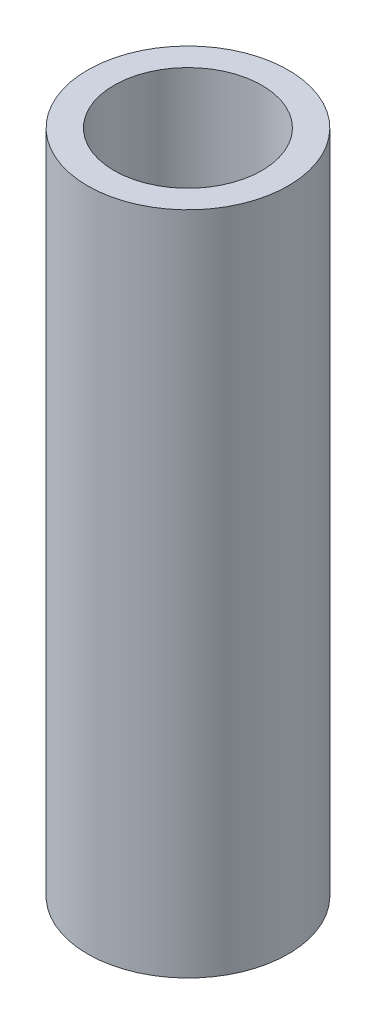
ISO-10303-21;
HEADER;
FILE_DESCRIPTION(('STEP AP214'),'2;1');
FILE_NAME('part.step','',(''),(''),'','','');
FILE_SCHEMA(('AUTOMOTIVE_DESIGN { 1 0 10303 214 1 1 1 1 }'));
ENDSEC;
DATA;
#1=APPLICATION_CONTEXT('core data for automotive mechanical design processes');
#2=APPLICATION_PROTOCOL_DEFINITION('international standard','automotive_design',2000,#1);
#3=PRODUCT_CONTEXT('',#1,'mechanical');
#4=PRODUCT('Part','Part','',(#3));
#5=PRODUCT_RELATED_PRODUCT_CATEGORY('part','',(#4));
#6=PRODUCT_DEFINITION_FORMATION('','',#4);
#7=PRODUCT_DEFINITION_CONTEXT('part definition',#1,'design');
#8=PRODUCT_DEFINITION('design','',#6,#7);
#9=PRODUCT_DEFINITION_SHAPE('','',#8);
#10=(LENGTH_UNIT() NAMED_UNIT(*) SI_UNIT(.MILLI.,.METRE.));
#11=(NAMED_UNIT(*) PLANE_ANGLE_UNIT() SI_UNIT($,.RADIAN.));
#12=(NAMED_UNIT(*) SI_UNIT($,.STERADIAN.) SOLID_ANGLE_UNIT());
#13=UNCERTAINTY_MEASURE_WITH_UNIT(LENGTH_MEASURE(1.E-05),#10,'distance_accuracy_value','');
#14=(GEOMETRIC_REPRESENTATION_CONTEXT(3) GLOBAL_UNCERTAINTY_ASSIGNED_CONTEXT((#13)) GLOBAL_UNIT_ASSIGNED_CONTEXT((#10,
#11,#12)) REPRESENTATION_CONTEXT('',''));
#15=CARTESIAN_POINT('',(0.,0.,0.));
#16=DIRECTION('',(0.,0.,1.));
#17=DIRECTION('',(1.,0.,0.));
#18=AXIS2_PLACEMENT_3D('',#15,#16,#17);
#19=CARTESIAN_POINT('',(0.,-2.,0.));
#20=DIRECTION('',(0.,1.,0.));
#21=DIRECTION('',(0.,0.,1.));
#22=AXIS2_PLACEMENT_3D('',#19,#20,#21);
#23=CYLINDRICAL_SURFACE('',#22,1.2065);
#24=CARTESIAN_POINT('',(0.,-2.,0.));
#25=DIRECTION('',(0.,1.,0.));
#26=DIRECTION('',(0.,0.,1.));
#27=AXIS2_PLACEMENT_3D('',#24,#25,#26);
#28=CIRCLE('',#27,1.2065);
#29=CARTESIAN_POINT('',(0.,-2.,1.2065));
#30=VERTEX_POINT('',#29);
#31=EDGE_CURVE('E10',#30,#30,#28,.T.);
#32=ORIENTED_EDGE('',*,*,#31,.T.);
#33=EDGE_LOOP('',(#32));
#34=FACE_BOUND('',#33,.T.);
#35=CARTESIAN_POINT('',(0.,6.,0.));
#36=DIRECTION('',(0.,1.,0.));
#37=DIRECTION('',(0.,0.,1.));
#38=AXIS2_PLACEMENT_3D('',#35,#36,#37);
#39=CIRCLE('',#38,1.2065);
#40=CARTESIAN_POINT('',(0.,6.,1.2065));
#41=VERTEX_POINT('',#40);
#42=EDGE_CURVE('E41',#41,#41,#39,.T.);
#43=ORIENTED_EDGE('',*,*,#42,.F.);
#44=EDGE_LOOP('',(#43));
#45=FACE_BOUND('',#44,.T.);
#46=ADVANCED_FACE('F31',(#34,#45),#23,.T.);
#47=CARTESIAN_POINT('',(0.,-2.,0.));
#48=DIRECTION('',(0.,1.,0.));
#49=DIRECTION('',(0.,0.,1.));
#50=AXIS2_PLACEMENT_3D('',#47,#48,#49);
#51=PLANE('',#50);
#52=CARTESIAN_POINT('',(0.,-2.,0.));
#53=DIRECTION('',(0.,1.,0.));
#54=DIRECTION('',(0.,0.,1.));
#55=AXIS2_PLACEMENT_3D('',#52,#53,#54);
#56=CIRCLE('',#55,0.889);
#57=CARTESIAN_POINT('',(0.,-2.,0.889));
#58=VERTEX_POINT('',#57);
#59=EDGE_CURVE('E37',#58,#58,#56,.T.);
#60=ORIENTED_EDGE('',*,*,#59,.T.);
#61=EDGE_LOOP('',(#60));
#62=FACE_BOUND('',#61,.T.);
#63=ORIENTED_EDGE('',*,*,#31,.F.);
#64=EDGE_LOOP('',(#63));
#65=FACE_BOUND('',#64,.T.);
#66=ADVANCED_FACE('F60',(#62,#65),#51,.F.);
#67=CARTESIAN_POINT('',(0.,-2.,0.));
#68=DIRECTION('',(0.,1.,0.));
#69=DIRECTION('',(0.,0.,1.));
#70=AXIS2_PLACEMENT_3D('',#67,#68,#69);
#71=CYLINDRICAL_SURFACE('',#70,0.889);
#72=ORIENTED_EDGE('',*,*,#59,.F.);
#73=EDGE_LOOP('',(#72));
#74=FACE_BOUND('',#73,.T.);
#75=CARTESIAN_POINT('',(0.,6.,0.));
#76=DIRECTION('',(0.,1.,0.));
#77=DIRECTION('',(0.,0.,1.));
#78=AXIS2_PLACEMENT_3D('',#75,#76,#77);
#79=CIRCLE('',#78,0.889);
#80=CARTESIAN_POINT('',(0.,6.,0.889));
#81=VERTEX_POINT('',#80);
#82=EDGE_CURVE('E45',#81,#81,#79,.T.);
#83=ORIENTED_EDGE('',*,*,#82,.T.);
#84=EDGE_LOOP('',(#83));
#85=FACE_BOUND('',#84,.T.);
#86=ADVANCED_FACE('F51',(#74,#85),#71,.F.);
#87=CARTESIAN_POINT('',(0.,6.,0.));
#88=DIRECTION('',(0.,1.,0.));
#89=DIRECTION('',(0.,0.,1.));
#90=AXIS2_PLACEMENT_3D('',#87,#88,#89);
#91=PLANE('',#90);
#92=ORIENTED_EDGE('',*,*,#42,.T.);
#93=EDGE_LOOP('',(#92));
#94=FACE_BOUND('',#93,.T.);
#95=ORIENTED_EDGE('',*,*,#82,.F.);
#96=EDGE_LOOP('',(#95));
#97=FACE_BOUND('',#96,.T.);
#98=ADVANCED_FACE('F53',(#94,#97),#91,.T.);
#99=CLOSED_SHELL('',(#46,#66,#86,#98));
#100=MANIFOLD_SOLID_BREP('B2',#99);
#101=ADVANCED_BREP_SHAPE_REPRESENTATION('',(#18,#100),#14);
#102=SHAPE_DEFINITION_REPRESENTATION(#9,#101);
ENDSEC;
END-ISO-10303-21;
